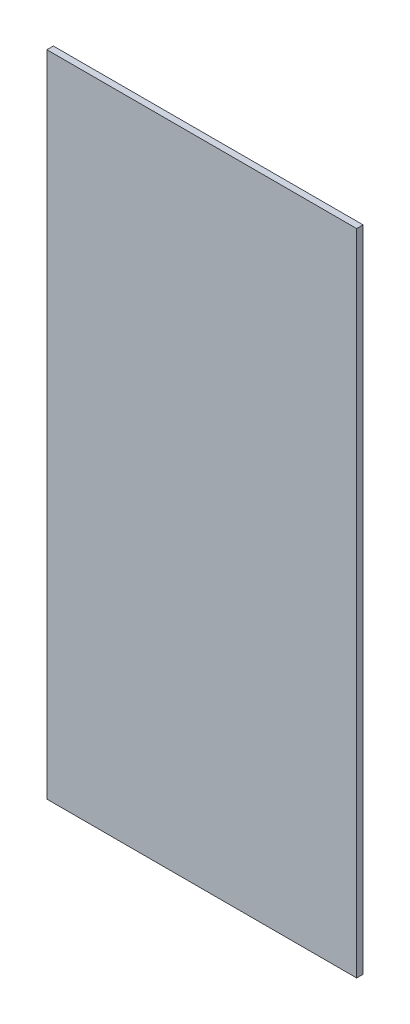
ISO-10303-21;
HEADER;
FILE_DESCRIPTION(('STEP AP214'),'2;1');
FILE_NAME('part.step','',(''),(''),'','','');
FILE_SCHEMA(('AUTOMOTIVE_DESIGN { 1 0 10303 214 1 1 1 1 }'));
ENDSEC;
DATA;
#1=APPLICATION_CONTEXT('core data for automotive mechanical design processes');
#2=APPLICATION_PROTOCOL_DEFINITION('international standard','automotive_design',2000,#1);
#3=PRODUCT_CONTEXT('',#1,'mechanical');
#4=PRODUCT('Part','Part','',(#3));
#5=PRODUCT_RELATED_PRODUCT_CATEGORY('part','',(#4));
#6=PRODUCT_DEFINITION_FORMATION('','',#4);
#7=PRODUCT_DEFINITION_CONTEXT('part definition',#1,'design');
#8=PRODUCT_DEFINITION('design','',#6,#7);
#9=PRODUCT_DEFINITION_SHAPE('','',#8);
#10=(LENGTH_UNIT() NAMED_UNIT(*) SI_UNIT(.MILLI.,.METRE.));
#11=(NAMED_UNIT(*) PLANE_ANGLE_UNIT() SI_UNIT($,.RADIAN.));
#12=(NAMED_UNIT(*) SI_UNIT($,.STERADIAN.) SOLID_ANGLE_UNIT());
#13=UNCERTAINTY_MEASURE_WITH_UNIT(LENGTH_MEASURE(1.E-05),#10,'distance_accuracy_value','');
#14=(GEOMETRIC_REPRESENTATION_CONTEXT(3) GLOBAL_UNCERTAINTY_ASSIGNED_CONTEXT((#13)) GLOBAL_UNIT_ASSIGNED_CONTEXT((#10,
#11,#12)) REPRESENTATION_CONTEXT('',''));
#15=CARTESIAN_POINT('',(0.,0.,0.));
#16=DIRECTION('',(0.,0.,1.));
#17=DIRECTION('',(1.,0.,0.));
#18=AXIS2_PLACEMENT_3D('',#15,#16,#17);
#19=CARTESIAN_POINT('',(0.,0.,3.175));
#20=DIRECTION('',(1.,0.,0.));
#21=DIRECTION('',(0.,0.,-1.));
#22=AXIS2_PLACEMENT_3D('',#19,#20,#21);
#23=PLANE('',#22);
#24=DIRECTION('',(0.,-1.,0.));
#25=VECTOR('',#24,1.);
#26=CARTESIAN_POINT('',(0.,0.,0.));
#27=LINE('',#26,#25);
#28=CARTESIAN_POINT('',(0.,319.278,0.));
#29=VERTEX_POINT('',#28);
#30=CARTESIAN_POINT('',(0.,0.,0.));
#31=VERTEX_POINT('',#30);
#32=EDGE_CURVE('E95',#29,#31,#27,.T.);
#33=ORIENTED_EDGE('',*,*,#32,.T.);
#34=DIRECTION('',(0.,0.,-1.));
#35=VECTOR('',#34,1.);
#36=CARTESIAN_POINT('',(0.,0.,3.175));
#37=LINE('',#36,#35);
#38=CARTESIAN_POINT('',(0.,0.,3.175));
#39=VERTEX_POINT('',#38);
#40=EDGE_CURVE('E11',#39,#31,#37,.T.);
#41=ORIENTED_EDGE('',*,*,#40,.F.);
#42=DIRECTION('',(0.,-1.,0.));
#43=VECTOR('',#42,1.);
#44=CARTESIAN_POINT('',(0.,0.,3.175));
#45=LINE('',#44,#43);
#46=CARTESIAN_POINT('',(0.,319.278,3.175));
#47=VERTEX_POINT('',#46);
#48=EDGE_CURVE('E83',#47,#39,#45,.T.);
#49=ORIENTED_EDGE('',*,*,#48,.F.);
#50=DIRECTION('',(0.,0.,-1.));
#51=VECTOR('',#50,1.);
#52=CARTESIAN_POINT('',(0.,319.278,3.175));
#53=LINE('',#52,#51);
#54=EDGE_CURVE('E91',#47,#29,#53,.T.);
#55=ORIENTED_EDGE('',*,*,#54,.T.);
#56=EDGE_LOOP('',(#33,#41,#49,#55));
#57=FACE_BOUND('',#56,.T.);
#58=ADVANCED_FACE('F32',(#57),#23,.F.);
#59=CARTESIAN_POINT('',(0.,0.,3.175));
#60=DIRECTION('',(0.,1.,0.));
#61=DIRECTION('',(0.,0.,1.));
#62=AXIS2_PLACEMENT_3D('',#59,#60,#61);
#63=PLANE('',#62);
#64=DIRECTION('',(1.,0.,0.));
#65=VECTOR('',#64,1.);
#66=CARTESIAN_POINT('',(0.,0.,0.));
#67=LINE('',#66,#65);
#68=CARTESIAN_POINT('',(152.4,0.,0.));
#69=VERTEX_POINT('',#68);
#70=EDGE_CURVE('E87',#31,#69,#67,.T.);
#71=ORIENTED_EDGE('',*,*,#70,.T.);
#72=DIRECTION('',(0.,0.,-1.));
#73=VECTOR('',#72,1.);
#74=CARTESIAN_POINT('',(152.4,0.,3.175));
#75=LINE('',#74,#73);
#76=CARTESIAN_POINT('',(152.4,0.,3.175));
#77=VERTEX_POINT('',#76);
#78=EDGE_CURVE('E40',#77,#69,#75,.T.);
#79=ORIENTED_EDGE('',*,*,#78,.F.);
#80=DIRECTION('',(1.,0.,0.));
#81=VECTOR('',#80,1.);
#82=CARTESIAN_POINT('',(0.,0.,3.175));
#83=LINE('',#82,#81);
#84=EDGE_CURVE('E78',#39,#77,#83,.T.);
#85=ORIENTED_EDGE('',*,*,#84,.F.);
#86=ORIENTED_EDGE('',*,*,#40,.T.);
#87=EDGE_LOOP('',(#71,#79,#85,#86));
#88=FACE_BOUND('',#87,.T.);
#89=ADVANCED_FACE('F86',(#88),#63,.F.);
#90=CARTESIAN_POINT('',(152.4,0.,3.175));
#91=DIRECTION('',(-1.,0.,0.));
#92=DIRECTION('',(0.,0.,1.));
#93=AXIS2_PLACEMENT_3D('',#90,#91,#92);
#94=PLANE('',#93);
#95=DIRECTION('',(0.,1.,0.));
#96=VECTOR('',#95,1.);
#97=CARTESIAN_POINT('',(152.4,0.,0.));
#98=LINE('',#97,#96);
#99=CARTESIAN_POINT('',(152.4,319.278,0.));
#100=VERTEX_POINT('',#99);
#101=EDGE_CURVE('E65',#69,#100,#98,.T.);
#102=ORIENTED_EDGE('',*,*,#101,.T.);
#103=DIRECTION('',(0.,0.,-1.));
#104=VECTOR('',#103,1.);
#105=CARTESIAN_POINT('',(152.4,319.278,3.175));
#106=LINE('',#105,#104);
#107=CARTESIAN_POINT('',(152.4,319.278,3.175));
#108=VERTEX_POINT('',#107);
#109=EDGE_CURVE('E88',#108,#100,#106,.T.);
#110=ORIENTED_EDGE('',*,*,#109,.F.);
#111=DIRECTION('',(0.,1.,0.));
#112=VECTOR('',#111,1.);
#113=CARTESIAN_POINT('',(152.4,0.,3.175));
#114=LINE('',#113,#112);
#115=EDGE_CURVE('E81',#77,#108,#114,.T.);
#116=ORIENTED_EDGE('',*,*,#115,.F.);
#117=ORIENTED_EDGE('',*,*,#78,.T.);
#118=EDGE_LOOP('',(#102,#110,#116,#117));
#119=FACE_BOUND('',#118,.T.);
#120=ADVANCED_FACE('F89',(#119),#94,.F.);
#121=CARTESIAN_POINT('',(0.,319.278,3.175));
#122=DIRECTION('',(0.,-1.,0.));
#123=DIRECTION('',(0.,0.,-1.));
#124=AXIS2_PLACEMENT_3D('',#121,#122,#123);
#125=PLANE('',#124);
#126=DIRECTION('',(-1.,0.,0.));
#127=VECTOR('',#126,1.);
#128=CARTESIAN_POINT('',(0.,319.278,0.));
#129=LINE('',#128,#127);
#130=EDGE_CURVE('E71',#100,#29,#129,.T.);
#131=ORIENTED_EDGE('',*,*,#130,.T.);
#132=ORIENTED_EDGE('',*,*,#54,.F.);
#133=DIRECTION('',(-1.,0.,0.));
#134=VECTOR('',#133,1.);
#135=CARTESIAN_POINT('',(0.,319.278,3.175));
#136=LINE('',#135,#134);
#137=EDGE_CURVE('E48',#108,#47,#136,.T.);
#138=ORIENTED_EDGE('',*,*,#137,.F.);
#139=ORIENTED_EDGE('',*,*,#109,.T.);
#140=EDGE_LOOP('',(#131,#132,#138,#139));
#141=FACE_BOUND('',#140,.T.);
#142=ADVANCED_FACE('F102',(#141),#125,.F.);
#143=CARTESIAN_POINT('',(0.,0.,3.175));
#144=DIRECTION('',(0.,0.,-1.));
#145=DIRECTION('',(-1.,0.,0.));
#146=AXIS2_PLACEMENT_3D('',#143,#144,#145);
#147=PLANE('',#146);
#148=ORIENTED_EDGE('',*,*,#48,.T.);
#149=ORIENTED_EDGE('',*,*,#84,.T.);
#150=ORIENTED_EDGE('',*,*,#115,.T.);
#151=ORIENTED_EDGE('',*,*,#137,.T.);
#152=EDGE_LOOP('',(#148,#149,#150,#151));
#153=FACE_BOUND('',#152,.T.);
#154=ADVANCED_FACE('F79',(#153),#147,.F.);
#155=CARTESIAN_POINT('',(0.,0.,0.));
#156=DIRECTION('',(0.,0.,-1.));
#157=DIRECTION('',(-1.,0.,0.));
#158=AXIS2_PLACEMENT_3D('',#155,#156,#157);
#159=PLANE('',#158);
#160=ORIENTED_EDGE('',*,*,#32,.F.);
#161=ORIENTED_EDGE('',*,*,#130,.F.);
#162=ORIENTED_EDGE('',*,*,#101,.F.);
#163=ORIENTED_EDGE('',*,*,#70,.F.);
#164=EDGE_LOOP('',(#160,#161,#162,#163));
#165=FACE_BOUND('',#164,.T.);
#166=ADVANCED_FACE('F105',(#165),#159,.T.);
#167=CLOSED_SHELL('',(#58,#89,#120,#142,#154,#166));
#168=MANIFOLD_SOLID_BREP('B2',#167);
#169=ADVANCED_BREP_SHAPE_REPRESENTATION('',(#18,#168),#14);
#170=SHAPE_DEFINITION_REPRESENTATION(#9,#169);
ENDSEC;
END-ISO-10303-21;
